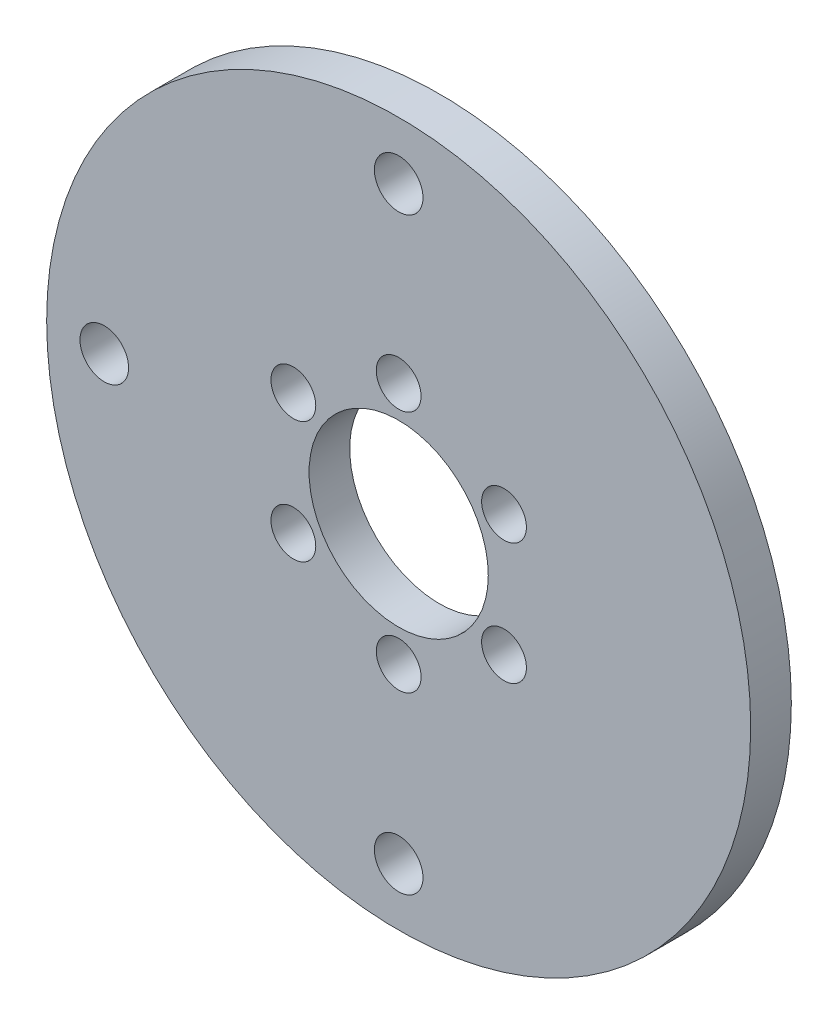
ISO-10303-21;
HEADER;
FILE_DESCRIPTION(('STEP AP214'),'2;1');
FILE_NAME('part.step','',(''),(''),'','','');
FILE_SCHEMA(('AUTOMOTIVE_DESIGN { 1 0 10303 214 1 1 1 1 }'));
ENDSEC;
DATA;
#1=APPLICATION_CONTEXT('core data for automotive mechanical design processes');
#2=APPLICATION_PROTOCOL_DEFINITION('international standard','automotive_design',2000,#1);
#3=PRODUCT_CONTEXT('',#1,'mechanical');
#4=PRODUCT('Part','Part','',(#3));
#5=PRODUCT_RELATED_PRODUCT_CATEGORY('part','',(#4));
#6=PRODUCT_DEFINITION_FORMATION('','',#4);
#7=PRODUCT_DEFINITION_CONTEXT('part definition',#1,'design');
#8=PRODUCT_DEFINITION('design','',#6,#7);
#9=PRODUCT_DEFINITION_SHAPE('','',#8);
#10=(LENGTH_UNIT() NAMED_UNIT(*) SI_UNIT(.MILLI.,.METRE.));
#11=(NAMED_UNIT(*) PLANE_ANGLE_UNIT() SI_UNIT($,.RADIAN.));
#12=(NAMED_UNIT(*) SI_UNIT($,.STERADIAN.) SOLID_ANGLE_UNIT());
#13=UNCERTAINTY_MEASURE_WITH_UNIT(LENGTH_MEASURE(1.E-05),#10,'distance_accuracy_value','');
#14=(GEOMETRIC_REPRESENTATION_CONTEXT(3) GLOBAL_UNCERTAINTY_ASSIGNED_CONTEXT((#13)) GLOBAL_UNIT_ASSIGNED_CONTEXT((#10,
#11,#12)) REPRESENTATION_CONTEXT('',''));
#15=CARTESIAN_POINT('',(0.,0.,0.));
#16=DIRECTION('',(0.,0.,1.));
#17=DIRECTION('',(1.,0.,0.));
#18=AXIS2_PLACEMENT_3D('',#15,#16,#17);
#19=CARTESIAN_POINT('',(0.,0.,3.175));
#20=DIRECTION('',(0.,0.,1.));
#21=DIRECTION('',(1.,0.,0.));
#22=AXIS2_PLACEMENT_3D('',#19,#20,#21);
#23=PLANE('',#22);
#24=CARTESIAN_POINT('',(-8.22724133595221,-4.74999999999992,3.175));
#25=DIRECTION('',(0.,0.,1.));
#26=DIRECTION('',(1.,0.,0.));
#27=AXIS2_PLACEMENT_3D('',#24,#25,#26);
#28=CIRCLE('',#27,1.75);
#29=CARTESIAN_POINT('',(-6.47724133595221,-4.74999999999992,3.175));
#30=VERTEX_POINT('',#29);
#31=EDGE_CURVE('E89',#30,#30,#28,.T.);
#32=ORIENTED_EDGE('',*,*,#31,.F.);
#33=EDGE_LOOP('',(#32));
#34=FACE_BOUND('',#33,.T.);
#35=CARTESIAN_POINT('',(8.22724133595212,-4.75000000000008,3.175));
#36=DIRECTION('',(0.,0.,1.));
#37=DIRECTION('',(1.,0.,0.));
#38=AXIS2_PLACEMENT_3D('',#35,#36,#37);
#39=CIRCLE('',#38,1.75);
#40=CARTESIAN_POINT('',(9.97724133595212,-4.75000000000008,3.175));
#41=VERTEX_POINT('',#40);
#42=EDGE_CURVE('E77',#41,#41,#39,.T.);
#43=ORIENTED_EDGE('',*,*,#42,.F.);
#44=EDGE_LOOP('',(#43));
#45=FACE_BOUND('',#44,.T.);
#46=CARTESIAN_POINT('',(-22.9999999999998,-3.99312779131623E-13,3.175));
#47=DIRECTION('',(0.,0.,1.));
#48=DIRECTION('',(1.,0.,0.));
#49=AXIS2_PLACEMENT_3D('',#46,#47,#48);
#50=CIRCLE('',#49,1.89865);
#51=CARTESIAN_POINT('',(-21.1013499999998,-3.99312779131623E-13,3.175));
#52=VERTEX_POINT('',#51);
#53=EDGE_CURVE('E65',#52,#52,#50,.T.);
#54=ORIENTED_EDGE('',*,*,#53,.F.);
#55=EDGE_LOOP('',(#54));
#56=FACE_BOUND('',#55,.T.);
#57=CARTESIAN_POINT('',(0.,9.5,3.175));
#58=DIRECTION('',(0.,0.,1.));
#59=DIRECTION('',(1.,0.,0.));
#60=AXIS2_PLACEMENT_3D('',#57,#58,#59);
#61=CIRCLE('',#60,1.75);
#62=CARTESIAN_POINT('',(1.75,9.5,3.175));
#63=VERTEX_POINT('',#62);
#64=EDGE_CURVE('E53',#63,#63,#61,.T.);
#65=ORIENTED_EDGE('',*,*,#64,.F.);
#66=EDGE_LOOP('',(#65));
#67=FACE_BOUND('',#66,.T.);
#68=CARTESIAN_POINT('',(0.,0.,3.175));
#69=DIRECTION('',(0.,0.,1.));
#70=DIRECTION('',(1.,0.,0.));
#71=AXIS2_PLACEMENT_3D('',#68,#69,#70);
#72=CIRCLE('',#71,7.);
#73=CARTESIAN_POINT('',(7.,0.,3.175));
#74=VERTEX_POINT('',#73);
#75=EDGE_CURVE('E42',#74,#74,#72,.T.);
#76=ORIENTED_EDGE('',*,*,#75,.F.);
#77=EDGE_LOOP('',(#76));
#78=FACE_BOUND('',#77,.T.);
#79=CARTESIAN_POINT('',(0.,0.,3.175));
#80=DIRECTION('',(0.,0.,1.));
#81=DIRECTION('',(1.,0.,0.));
#82=AXIS2_PLACEMENT_3D('',#79,#80,#81);
#83=CIRCLE('',#82,27.5);
#84=CARTESIAN_POINT('',(27.5,0.,3.175));
#85=VERTEX_POINT('',#84);
#86=EDGE_CURVE('E10',#85,#85,#83,.T.);
#87=ORIENTED_EDGE('',*,*,#86,.T.);
#88=EDGE_LOOP('',(#87));
#89=FACE_BOUND('',#88,.T.);
#90=CARTESIAN_POINT('',(0.,23.,3.175));
#91=DIRECTION('',(0.,0.,1.));
#92=DIRECTION('',(1.,0.,0.));
#93=AXIS2_PLACEMENT_3D('',#90,#91,#92);
#94=CIRCLE('',#93,1.89865);
#95=CARTESIAN_POINT('',(1.89865,23.,3.175));
#96=VERTEX_POINT('',#95);
#97=EDGE_CURVE('E47',#96,#96,#94,.T.);
#98=ORIENTED_EDGE('',*,*,#97,.F.);
#99=EDGE_LOOP('',(#98));
#100=FACE_BOUND('',#99,.T.);
#101=CARTESIAN_POINT('',(0.,-23.0000000000001,3.175));
#102=DIRECTION('',(0.,0.,1.));
#103=DIRECTION('',(1.,0.,0.));
#104=AXIS2_PLACEMENT_3D('',#101,#102,#103);
#105=CIRCLE('',#104,1.89865);
#106=CARTESIAN_POINT('',(1.89864999999992,-23.0000000000001,3.175));
#107=VERTEX_POINT('',#106);
#108=EDGE_CURVE('E59',#107,#107,#105,.T.);
#109=ORIENTED_EDGE('',*,*,#108,.F.);
#110=EDGE_LOOP('',(#109));
#111=FACE_BOUND('',#110,.T.);
#112=CARTESIAN_POINT('',(8.22724133595218,4.74999999999998,3.175));
#113=DIRECTION('',(0.,0.,1.));
#114=DIRECTION('',(1.,0.,0.));
#115=AXIS2_PLACEMENT_3D('',#112,#113,#114);
#116=CIRCLE('',#115,1.75);
#117=CARTESIAN_POINT('',(9.97724133595218,4.74999999999998,3.175));
#118=VERTEX_POINT('',#117);
#119=EDGE_CURVE('E71',#118,#118,#116,.T.);
#120=ORIENTED_EDGE('',*,*,#119,.F.);
#121=EDGE_LOOP('',(#120));
#122=FACE_BOUND('',#121,.T.);
#123=CARTESIAN_POINT('',(-1.10913882245267E-13,-9.5,3.175));
#124=DIRECTION('',(0.,0.,1.));
#125=DIRECTION('',(1.,0.,0.));
#126=AXIS2_PLACEMENT_3D('',#123,#124,#125);
#127=CIRCLE('',#126,1.75);
#128=CARTESIAN_POINT('',(1.74999999999989,-9.5,3.175));
#129=VERTEX_POINT('',#128);
#130=EDGE_CURVE('E83',#129,#129,#127,.T.);
#131=ORIENTED_EDGE('',*,*,#130,.F.);
#132=EDGE_LOOP('',(#131));
#133=FACE_BOUND('',#132,.T.);
#134=CARTESIAN_POINT('',(-8.22724133595212,4.7500000000001,3.175));
#135=DIRECTION('',(0.,0.,1.));
#136=DIRECTION('',(1.,0.,0.));
#137=AXIS2_PLACEMENT_3D('',#134,#135,#136);
#138=CIRCLE('',#137,1.75);
#139=CARTESIAN_POINT('',(-6.47724133595212,4.7500000000001,3.175));
#140=VERTEX_POINT('',#139);
#141=EDGE_CURVE('E95',#140,#140,#138,.T.);
#142=ORIENTED_EDGE('',*,*,#141,.F.);
#143=EDGE_LOOP('',(#142));
#144=FACE_BOUND('',#143,.T.);
#145=ADVANCED_FACE('F31',(#34,#45,#56,#67,#78,#89,#100,#111,#122,#133,#144),#23,.T.);
#146=CARTESIAN_POINT('',(0.,0.,0.));
#147=DIRECTION('',(0.,0.,1.));
#148=DIRECTION('',(1.,0.,0.));
#149=AXIS2_PLACEMENT_3D('',#146,#147,#148);
#150=PLANE('',#149);
#151=CARTESIAN_POINT('',(0.,0.,0.));
#152=DIRECTION('',(0.,0.,1.));
#153=DIRECTION('',(1.,0.,0.));
#154=AXIS2_PLACEMENT_3D('',#151,#152,#153);
#155=CIRCLE('',#154,27.5);
#156=CARTESIAN_POINT('',(27.5,0.,0.));
#157=VERTEX_POINT('',#156);
#158=EDGE_CURVE('E35',#157,#157,#155,.T.);
#159=ORIENTED_EDGE('',*,*,#158,.F.);
#160=EDGE_LOOP('',(#159));
#161=FACE_BOUND('',#160,.T.);
#162=CARTESIAN_POINT('',(0.,0.,0.));
#163=DIRECTION('',(0.,0.,1.));
#164=DIRECTION('',(1.,0.,0.));
#165=AXIS2_PLACEMENT_3D('',#162,#163,#164);
#166=CIRCLE('',#165,7.);
#167=CARTESIAN_POINT('',(7.,0.,0.));
#168=VERTEX_POINT('',#167);
#169=EDGE_CURVE('E44',#168,#168,#166,.T.);
#170=ORIENTED_EDGE('',*,*,#169,.T.);
#171=EDGE_LOOP('',(#170));
#172=FACE_BOUND('',#171,.T.);
#173=CARTESIAN_POINT('',(0.,23.,0.));
#174=DIRECTION('',(0.,0.,1.));
#175=DIRECTION('',(1.,0.,0.));
#176=AXIS2_PLACEMENT_3D('',#173,#174,#175);
#177=CIRCLE('',#176,1.89865);
#178=CARTESIAN_POINT('',(1.89865,23.,0.));
#179=VERTEX_POINT('',#178);
#180=EDGE_CURVE('E50',#179,#179,#177,.T.);
#181=ORIENTED_EDGE('',*,*,#180,.T.);
#182=EDGE_LOOP('',(#181));
#183=FACE_BOUND('',#182,.T.);
#184=CARTESIAN_POINT('',(0.,9.5,0.));
#185=DIRECTION('',(0.,0.,1.));
#186=DIRECTION('',(1.,0.,0.));
#187=AXIS2_PLACEMENT_3D('',#184,#185,#186);
#188=CIRCLE('',#187,1.75);
#189=CARTESIAN_POINT('',(1.75,9.5,0.));
#190=VERTEX_POINT('',#189);
#191=EDGE_CURVE('E56',#190,#190,#188,.T.);
#192=ORIENTED_EDGE('',*,*,#191,.T.);
#193=EDGE_LOOP('',(#192));
#194=FACE_BOUND('',#193,.T.);
#195=CARTESIAN_POINT('',(0.,-23.0000000000001,0.));
#196=DIRECTION('',(0.,0.,1.));
#197=DIRECTION('',(1.,0.,0.));
#198=AXIS2_PLACEMENT_3D('',#195,#196,#197);
#199=CIRCLE('',#198,1.89865);
#200=CARTESIAN_POINT('',(1.89864999999992,-23.0000000000001,0.));
#201=VERTEX_POINT('',#200);
#202=EDGE_CURVE('E62',#201,#201,#199,.T.);
#203=ORIENTED_EDGE('',*,*,#202,.T.);
#204=EDGE_LOOP('',(#203));
#205=FACE_BOUND('',#204,.T.);
#206=CARTESIAN_POINT('',(-22.9999999999998,-3.99312779131623E-13,0.));
#207=DIRECTION('',(0.,0.,1.));
#208=DIRECTION('',(1.,0.,0.));
#209=AXIS2_PLACEMENT_3D('',#206,#207,#208);
#210=CIRCLE('',#209,1.89865);
#211=CARTESIAN_POINT('',(-21.1013499999998,-3.99312779131623E-13,0.));
#212=VERTEX_POINT('',#211);
#213=EDGE_CURVE('E68',#212,#212,#210,.T.);
#214=ORIENTED_EDGE('',*,*,#213,.T.);
#215=EDGE_LOOP('',(#214));
#216=FACE_BOUND('',#215,.T.);
#217=CARTESIAN_POINT('',(8.22724133595218,4.74999999999998,0.));
#218=DIRECTION('',(0.,0.,1.));
#219=DIRECTION('',(1.,0.,0.));
#220=AXIS2_PLACEMENT_3D('',#217,#218,#219);
#221=CIRCLE('',#220,1.75);
#222=CARTESIAN_POINT('',(9.97724133595218,4.74999999999998,0.));
#223=VERTEX_POINT('',#222);
#224=EDGE_CURVE('E74',#223,#223,#221,.T.);
#225=ORIENTED_EDGE('',*,*,#224,.T.);
#226=EDGE_LOOP('',(#225));
#227=FACE_BOUND('',#226,.T.);
#228=CARTESIAN_POINT('',(8.22724133595212,-4.75000000000008,0.));
#229=DIRECTION('',(0.,0.,1.));
#230=DIRECTION('',(1.,0.,0.));
#231=AXIS2_PLACEMENT_3D('',#228,#229,#230);
#232=CIRCLE('',#231,1.75);
#233=CARTESIAN_POINT('',(9.97724133595212,-4.75000000000008,0.));
#234=VERTEX_POINT('',#233);
#235=EDGE_CURVE('E80',#234,#234,#232,.T.);
#236=ORIENTED_EDGE('',*,*,#235,.T.);
#237=EDGE_LOOP('',(#236));
#238=FACE_BOUND('',#237,.T.);
#239=CARTESIAN_POINT('',(-1.10913882245267E-13,-9.5,0.));
#240=DIRECTION('',(0.,0.,1.));
#241=DIRECTION('',(1.,0.,0.));
#242=AXIS2_PLACEMENT_3D('',#239,#240,#241);
#243=CIRCLE('',#242,1.75);
#244=CARTESIAN_POINT('',(1.74999999999989,-9.5,0.));
#245=VERTEX_POINT('',#244);
#246=EDGE_CURVE('E86',#245,#245,#243,.T.);
#247=ORIENTED_EDGE('',*,*,#246,.T.);
#248=EDGE_LOOP('',(#247));
#249=FACE_BOUND('',#248,.T.);
#250=CARTESIAN_POINT('',(-8.22724133595221,-4.74999999999992,0.));
#251=DIRECTION('',(0.,0.,1.));
#252=DIRECTION('',(1.,0.,0.));
#253=AXIS2_PLACEMENT_3D('',#250,#251,#252);
#254=CIRCLE('',#253,1.75);
#255=CARTESIAN_POINT('',(-6.47724133595221,-4.74999999999992,0.));
#256=VERTEX_POINT('',#255);
#257=EDGE_CURVE('E92',#256,#256,#254,.T.);
#258=ORIENTED_EDGE('',*,*,#257,.T.);
#259=EDGE_LOOP('',(#258));
#260=FACE_BOUND('',#259,.T.);
#261=CARTESIAN_POINT('',(-8.22724133595212,4.7500000000001,0.));
#262=DIRECTION('',(0.,0.,1.));
#263=DIRECTION('',(1.,0.,0.));
#264=AXIS2_PLACEMENT_3D('',#261,#262,#263);
#265=CIRCLE('',#264,1.75);
#266=CARTESIAN_POINT('',(-6.47724133595212,4.7500000000001,0.));
#267=VERTEX_POINT('',#266);
#268=EDGE_CURVE('E98',#267,#267,#265,.T.);
#269=ORIENTED_EDGE('',*,*,#268,.T.);
#270=EDGE_LOOP('',(#269));
#271=FACE_BOUND('',#270,.T.);
#272=ADVANCED_FACE('F108',(#161,#172,#183,#194,#205,#216,#227,#238,#249,#260,#271),#150,.F.);
#273=CARTESIAN_POINT('',(0.,0.,3.175));
#274=DIRECTION('',(0.,0.,-1.));
#275=DIRECTION('',(-1.,0.,0.));
#276=AXIS2_PLACEMENT_3D('',#273,#274,#275);
#277=CYLINDRICAL_SURFACE('',#276,27.5);
#278=ORIENTED_EDGE('',*,*,#86,.F.);
#279=EDGE_LOOP('',(#278));
#280=FACE_BOUND('',#279,.T.);
#281=ORIENTED_EDGE('',*,*,#158,.T.);
#282=EDGE_LOOP('',(#281));
#283=FACE_BOUND('',#282,.T.);
#284=ADVANCED_FACE('F33',(#280,#283),#277,.T.);
#285=CARTESIAN_POINT('',(0.,0.,3.175));
#286=DIRECTION('',(0.,0.,-1.));
#287=DIRECTION('',(-1.,0.,0.));
#288=AXIS2_PLACEMENT_3D('',#285,#286,#287);
#289=CYLINDRICAL_SURFACE('',#288,7.);
#290=ORIENTED_EDGE('',*,*,#75,.T.);
#291=EDGE_LOOP('',(#290));
#292=FACE_BOUND('',#291,.T.);
#293=ORIENTED_EDGE('',*,*,#169,.F.);
#294=EDGE_LOOP('',(#293));
#295=FACE_BOUND('',#294,.T.);
#296=ADVANCED_FACE('F118',(#292,#295),#289,.F.);
#297=CARTESIAN_POINT('',(0.,23.,3.175));
#298=DIRECTION('',(0.,0.,-1.));
#299=DIRECTION('',(-1.,0.,0.));
#300=AXIS2_PLACEMENT_3D('',#297,#298,#299);
#301=CYLINDRICAL_SURFACE('',#300,1.89865);
#302=ORIENTED_EDGE('',*,*,#97,.T.);
#303=EDGE_LOOP('',(#302));
#304=FACE_BOUND('',#303,.T.);
#305=ORIENTED_EDGE('',*,*,#180,.F.);
#306=EDGE_LOOP('',(#305));
#307=FACE_BOUND('',#306,.T.);
#308=ADVANCED_FACE('F121',(#304,#307),#301,.F.);
#309=CARTESIAN_POINT('',(0.,9.5,3.175));
#310=DIRECTION('',(0.,0.,-1.));
#311=DIRECTION('',(-1.,0.,0.));
#312=AXIS2_PLACEMENT_3D('',#309,#310,#311);
#313=CYLINDRICAL_SURFACE('',#312,1.75);
#314=ORIENTED_EDGE('',*,*,#64,.T.);
#315=EDGE_LOOP('',(#314));
#316=FACE_BOUND('',#315,.T.);
#317=ORIENTED_EDGE('',*,*,#191,.F.);
#318=EDGE_LOOP('',(#317));
#319=FACE_BOUND('',#318,.T.);
#320=ADVANCED_FACE('F125',(#316,#319),#313,.F.);
#321=CARTESIAN_POINT('',(0.,-23.0000000000001,3.175));
#322=DIRECTION('',(0.,0.,-1.));
#323=DIRECTION('',(-1.,0.,0.));
#324=AXIS2_PLACEMENT_3D('',#321,#322,#323);
#325=CYLINDRICAL_SURFACE('',#324,1.89865);
#326=ORIENTED_EDGE('',*,*,#108,.T.);
#327=EDGE_LOOP('',(#326));
#328=FACE_BOUND('',#327,.T.);
#329=ORIENTED_EDGE('',*,*,#202,.F.);
#330=EDGE_LOOP('',(#329));
#331=FACE_BOUND('',#330,.T.);
#332=ADVANCED_FACE('F129',(#328,#331),#325,.F.);
#333=CARTESIAN_POINT('',(-22.9999999999998,-3.99312779131623E-13,3.175));
#334=DIRECTION('',(0.,0.,-1.));
#335=DIRECTION('',(-1.,0.,0.));
#336=AXIS2_PLACEMENT_3D('',#333,#334,#335);
#337=CYLINDRICAL_SURFACE('',#336,1.89865);
#338=ORIENTED_EDGE('',*,*,#53,.T.);
#339=EDGE_LOOP('',(#338));
#340=FACE_BOUND('',#339,.T.);
#341=ORIENTED_EDGE('',*,*,#213,.F.);
#342=EDGE_LOOP('',(#341));
#343=FACE_BOUND('',#342,.T.);
#344=ADVANCED_FACE('F133',(#340,#343),#337,.F.);
#345=CARTESIAN_POINT('',(8.22724133595218,4.74999999999998,3.175));
#346=DIRECTION('',(0.,0.,-1.));
#347=DIRECTION('',(-1.,0.,0.));
#348=AXIS2_PLACEMENT_3D('',#345,#346,#347);
#349=CYLINDRICAL_SURFACE('',#348,1.75);
#350=ORIENTED_EDGE('',*,*,#119,.T.);
#351=EDGE_LOOP('',(#350));
#352=FACE_BOUND('',#351,.T.);
#353=ORIENTED_EDGE('',*,*,#224,.F.);
#354=EDGE_LOOP('',(#353));
#355=FACE_BOUND('',#354,.T.);
#356=ADVANCED_FACE('F137',(#352,#355),#349,.F.);
#357=CARTESIAN_POINT('',(8.22724133595212,-4.75000000000008,3.175));
#358=DIRECTION('',(0.,0.,-1.));
#359=DIRECTION('',(-1.,0.,0.));
#360=AXIS2_PLACEMENT_3D('',#357,#358,#359);
#361=CYLINDRICAL_SURFACE('',#360,1.75);
#362=ORIENTED_EDGE('',*,*,#42,.T.);
#363=EDGE_LOOP('',(#362));
#364=FACE_BOUND('',#363,.T.);
#365=ORIENTED_EDGE('',*,*,#235,.F.);
#366=EDGE_LOOP('',(#365));
#367=FACE_BOUND('',#366,.T.);
#368=ADVANCED_FACE('F141',(#364,#367),#361,.F.);
#369=CARTESIAN_POINT('',(-1.10913882245267E-13,-9.5,3.175));
#370=DIRECTION('',(0.,0.,-1.));
#371=DIRECTION('',(-1.,0.,0.));
#372=AXIS2_PLACEMENT_3D('',#369,#370,#371);
#373=CYLINDRICAL_SURFACE('',#372,1.75);
#374=ORIENTED_EDGE('',*,*,#130,.T.);
#375=EDGE_LOOP('',(#374));
#376=FACE_BOUND('',#375,.T.);
#377=ORIENTED_EDGE('',*,*,#246,.F.);
#378=EDGE_LOOP('',(#377));
#379=FACE_BOUND('',#378,.T.);
#380=ADVANCED_FACE('F145',(#376,#379),#373,.F.);
#381=CARTESIAN_POINT('',(-8.22724133595221,-4.74999999999992,3.175));
#382=DIRECTION('',(0.,0.,-1.));
#383=DIRECTION('',(-1.,0.,0.));
#384=AXIS2_PLACEMENT_3D('',#381,#382,#383);
#385=CYLINDRICAL_SURFACE('',#384,1.75);
#386=ORIENTED_EDGE('',*,*,#31,.T.);
#387=EDGE_LOOP('',(#386));
#388=FACE_BOUND('',#387,.T.);
#389=ORIENTED_EDGE('',*,*,#257,.F.);
#390=EDGE_LOOP('',(#389));
#391=FACE_BOUND('',#390,.T.);
#392=ADVANCED_FACE('F149',(#388,#391),#385,.F.);
#393=CARTESIAN_POINT('',(-8.22724133595212,4.7500000000001,3.175));
#394=DIRECTION('',(0.,0.,-1.));
#395=DIRECTION('',(-1.,0.,0.));
#396=AXIS2_PLACEMENT_3D('',#393,#394,#395);
#397=CYLINDRICAL_SURFACE('',#396,1.75);
#398=ORIENTED_EDGE('',*,*,#141,.T.);
#399=EDGE_LOOP('',(#398));
#400=FACE_BOUND('',#399,.T.);
#401=ORIENTED_EDGE('',*,*,#268,.F.);
#402=EDGE_LOOP('',(#401));
#403=FACE_BOUND('',#402,.T.);
#404=ADVANCED_FACE('F104',(#400,#403),#397,.F.);
#405=CLOSED_SHELL('',(#145,#272,#284,#296,#308,#320,#332,#344,#356,#368,#380,#392,#404));
#406=MANIFOLD_SOLID_BREP('B2',#405);
#407=ADVANCED_BREP_SHAPE_REPRESENTATION('',(#18,#406),#14);
#408=SHAPE_DEFINITION_REPRESENTATION(#9,#407);
ENDSEC;
END-ISO-10303-21;
